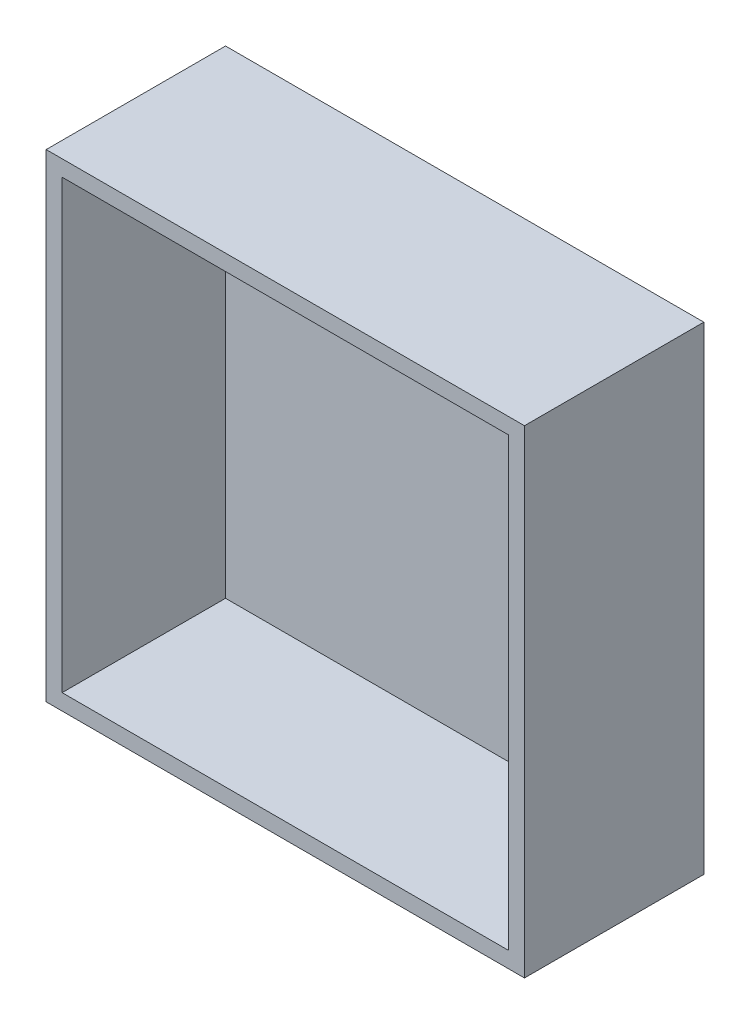
ISO-10303-21;
HEADER;
FILE_DESCRIPTION(('STEP AP214'),'2;1');
FILE_NAME('part.step','',(''),(''),'','','');
FILE_SCHEMA(('AUTOMOTIVE_DESIGN { 1 0 10303 214 1 1 1 1 }'));
ENDSEC;
DATA;
#1=APPLICATION_CONTEXT('core data for automotive mechanical design processes');
#2=APPLICATION_PROTOCOL_DEFINITION('international standard','automotive_design',2000,#1);
#3=PRODUCT_CONTEXT('',#1,'mechanical');
#4=PRODUCT('Part','Part','',(#3));
#5=PRODUCT_RELATED_PRODUCT_CATEGORY('part','',(#4));
#6=PRODUCT_DEFINITION_FORMATION('','',#4);
#7=PRODUCT_DEFINITION_CONTEXT('part definition',#1,'design');
#8=PRODUCT_DEFINITION('design','',#6,#7);
#9=PRODUCT_DEFINITION_SHAPE('','',#8);
#10=(LENGTH_UNIT() NAMED_UNIT(*) SI_UNIT(.MILLI.,.METRE.));
#11=(NAMED_UNIT(*) PLANE_ANGLE_UNIT() SI_UNIT($,.RADIAN.));
#12=(NAMED_UNIT(*) SI_UNIT($,.STERADIAN.) SOLID_ANGLE_UNIT());
#13=UNCERTAINTY_MEASURE_WITH_UNIT(LENGTH_MEASURE(1.E-05),#10,'distance_accuracy_value','');
#14=(GEOMETRIC_REPRESENTATION_CONTEXT(3) GLOBAL_UNCERTAINTY_ASSIGNED_CONTEXT((#13)) GLOBAL_UNIT_ASSIGNED_CONTEXT((#10,
#11,#12)) REPRESENTATION_CONTEXT('',''));
#15=CARTESIAN_POINT('',(0.,0.,0.));
#16=DIRECTION('',(0.,0.,1.));
#17=DIRECTION('',(1.,0.,0.));
#18=AXIS2_PLACEMENT_3D('',#15,#16,#17);
#19=CARTESIAN_POINT('',(-28.,-28.,2.));
#20=DIRECTION('',(-1.,0.,0.));
#21=DIRECTION('',(0.,-1.,0.));
#22=AXIS2_PLACEMENT_3D('',#19,#20,#21);
#23=PLANE('',#22);
#24=DIRECTION('',(0.,0.,-1.));
#25=VECTOR('',#24,1.);
#26=CARTESIAN_POINT('',(-28.,19.,11.));
#27=LINE('',#26,#25);
#28=CARTESIAN_POINT('',(-28.,19.,11.));
#29=VERTEX_POINT('',#28);
#30=CARTESIAN_POINT('',(-28.,19.,2.));
#31=VERTEX_POINT('',#30);
#32=EDGE_CURVE('E55',#29,#31,#27,.T.);
#33=ORIENTED_EDGE('',*,*,#32,.F.);
#34=DIRECTION('',(0.,-1.,0.));
#35=VECTOR('',#34,1.);
#36=CARTESIAN_POINT('',(-28.,28.,11.));
#37=LINE('',#36,#35);
#38=CARTESIAN_POINT('',(-28.,28.,11.));
#39=VERTEX_POINT('',#38);
#40=EDGE_CURVE('E130',#39,#29,#37,.T.);
#41=ORIENTED_EDGE('',*,*,#40,.F.);
#42=DIRECTION('',(0.,0.,1.));
#43=VECTOR('',#42,1.);
#44=CARTESIAN_POINT('',(-28.,28.,2.));
#45=LINE('',#44,#43);
#46=CARTESIAN_POINT('',(-28.,28.,22.5));
#47=VERTEX_POINT('',#46);
#48=EDGE_CURVE('E203',#39,#47,#45,.T.);
#49=ORIENTED_EDGE('',*,*,#48,.T.);
#50=DIRECTION('',(0.,-1.,0.));
#51=VECTOR('',#50,1.);
#52=CARTESIAN_POINT('',(-28.,-28.,22.5));
#53=LINE('',#52,#51);
#54=CARTESIAN_POINT('',(-28.,-28.,22.5));
#55=VERTEX_POINT('',#54);
#56=EDGE_CURVE('E189',#47,#55,#53,.T.);
#57=ORIENTED_EDGE('',*,*,#56,.T.);
#58=DIRECTION('',(0.,0.,1.));
#59=VECTOR('',#58,1.);
#60=CARTESIAN_POINT('',(-28.,-28.,2.));
#61=LINE('',#60,#59);
#62=CARTESIAN_POINT('',(-28.,-28.,2.));
#63=VERTEX_POINT('',#62);
#64=EDGE_CURVE('E200',#63,#55,#61,.T.);
#65=ORIENTED_EDGE('',*,*,#64,.F.);
#66=DIRECTION('',(0.,-1.,0.));
#67=VECTOR('',#66,1.);
#68=CARTESIAN_POINT('',(-28.,-28.,2.));
#69=LINE('',#68,#67);
#70=EDGE_CURVE('E175',#31,#63,#69,.T.);
#71=ORIENTED_EDGE('',*,*,#70,.F.);
#72=EDGE_LOOP('',(#33,#41,#49,#57,#65,#71));
#73=FACE_BOUND('',#72,.T.);
#74=ADVANCED_FACE('F39',(#73),#23,.F.);
#75=CARTESIAN_POINT('',(-28.,28.,2.));
#76=DIRECTION('',(0.,1.,0.));
#77=DIRECTION('',(-1.,0.,0.));
#78=AXIS2_PLACEMENT_3D('',#75,#76,#77);
#79=PLANE('',#78);
#80=DIRECTION('',(0.,0.,-1.));
#81=VECTOR('',#80,1.);
#82=CARTESIAN_POINT('',(-18.,28.,11.));
#83=LINE('',#82,#81);
#84=CARTESIAN_POINT('',(-18.,28.,11.));
#85=VERTEX_POINT('',#84);
#86=CARTESIAN_POINT('',(-18.,28.,2.));
#87=VERTEX_POINT('',#86);
#88=EDGE_CURVE('E144',#85,#87,#83,.T.);
#89=ORIENTED_EDGE('',*,*,#88,.T.);
#90=DIRECTION('',(-1.,0.,0.));
#91=VECTOR('',#90,1.);
#92=CARTESIAN_POINT('',(-28.,28.,2.));
#93=LINE('',#92,#91);
#94=CARTESIAN_POINT('',(28.,28.,2.));
#95=VERTEX_POINT('',#94);
#96=EDGE_CURVE('E170',#95,#87,#93,.T.);
#97=ORIENTED_EDGE('',*,*,#96,.F.);
#98=DIRECTION('',(0.,0.,1.));
#99=VECTOR('',#98,1.);
#100=CARTESIAN_POINT('',(28.,28.,2.));
#101=LINE('',#100,#99);
#102=CARTESIAN_POINT('',(28.,28.,22.5));
#103=VERTEX_POINT('',#102);
#104=EDGE_CURVE('E182',#95,#103,#101,.T.);
#105=ORIENTED_EDGE('',*,*,#104,.T.);
#106=DIRECTION('',(-1.,0.,0.));
#107=VECTOR('',#106,1.);
#108=CARTESIAN_POINT('',(-28.,28.,22.5));
#109=LINE('',#108,#107);
#110=EDGE_CURVE('E185',#103,#47,#109,.T.);
#111=ORIENTED_EDGE('',*,*,#110,.T.);
#112=ORIENTED_EDGE('',*,*,#48,.F.);
#113=DIRECTION('',(-1.,0.,0.));
#114=VECTOR('',#113,1.);
#115=CARTESIAN_POINT('',(-28.,28.,11.));
#116=LINE('',#115,#114);
#117=EDGE_CURVE('E63',#85,#39,#116,.T.);
#118=ORIENTED_EDGE('',*,*,#117,.F.);
#119=EDGE_LOOP('',(#89,#97,#105,#111,#112,#118));
#120=FACE_BOUND('',#119,.T.);
#121=ADVANCED_FACE('F272',(#120),#79,.F.);
#122=CARTESIAN_POINT('',(0.,0.,2.));
#123=DIRECTION('',(0.,0.,-1.));
#124=DIRECTION('',(-1.,0.,0.));
#125=AXIS2_PLACEMENT_3D('',#122,#123,#124);
#126=PLANE('',#125);
#127=DIRECTION('',(0.,1.,0.));
#128=VECTOR('',#127,1.);
#129=CARTESIAN_POINT('',(-18.,28.,2.));
#130=LINE('',#129,#128);
#131=CARTESIAN_POINT('',(-18.,19.,2.));
#132=VERTEX_POINT('',#131);
#133=EDGE_CURVE('E150',#132,#87,#130,.T.);
#134=ORIENTED_EDGE('',*,*,#133,.F.);
#135=DIRECTION('',(1.,0.,0.));
#136=VECTOR('',#135,1.);
#137=CARTESIAN_POINT('',(-28.,19.,2.));
#138=LINE('',#137,#136);
#139=EDGE_CURVE('E138',#31,#132,#138,.T.);
#140=ORIENTED_EDGE('',*,*,#139,.F.);
#141=ORIENTED_EDGE('',*,*,#70,.T.);
#142=DIRECTION('',(1.,0.,0.));
#143=VECTOR('',#142,1.);
#144=CARTESIAN_POINT('',(-28.,-28.,2.));
#145=LINE('',#144,#143);
#146=CARTESIAN_POINT('',(28.,-28.,2.));
#147=VERTEX_POINT('',#146);
#148=EDGE_CURVE('E178',#63,#147,#145,.T.);
#149=ORIENTED_EDGE('',*,*,#148,.T.);
#150=DIRECTION('',(0.,1.,0.));
#151=VECTOR('',#150,1.);
#152=CARTESIAN_POINT('',(28.,-28.,2.));
#153=LINE('',#152,#151);
#154=EDGE_CURVE('E166',#147,#95,#153,.T.);
#155=ORIENTED_EDGE('',*,*,#154,.T.);
#156=ORIENTED_EDGE('',*,*,#96,.T.);
#157=EDGE_LOOP('',(#134,#140,#141,#149,#155,#156));
#158=FACE_BOUND('',#157,.T.);
#159=ADVANCED_FACE('F270',(#158),#126,.F.);
#160=CARTESIAN_POINT('',(30.,-30.,22.5));
#161=DIRECTION('',(-1.,0.,0.));
#162=DIRECTION('',(0.,0.,1.));
#163=AXIS2_PLACEMENT_3D('',#160,#161,#162);
#164=PLANE('',#163);
#165=DIRECTION('',(0.,1.,0.));
#166=VECTOR('',#165,1.);
#167=CARTESIAN_POINT('',(30.,-30.,0.));
#168=LINE('',#167,#166);
#169=CARTESIAN_POINT('',(30.,-30.,0.));
#170=VERTEX_POINT('',#169);
#171=CARTESIAN_POINT('',(30.,30.,0.));
#172=VERTEX_POINT('',#171);
#173=EDGE_CURVE('E199',#170,#172,#168,.T.);
#174=ORIENTED_EDGE('',*,*,#173,.T.);
#175=DIRECTION('',(0.,0.,-1.));
#176=VECTOR('',#175,1.);
#177=CARTESIAN_POINT('',(30.,30.,22.5));
#178=LINE('',#177,#176);
#179=CARTESIAN_POINT('',(30.,30.,22.5));
#180=VERTEX_POINT('',#179);
#181=EDGE_CURVE('E11',#180,#172,#178,.T.);
#182=ORIENTED_EDGE('',*,*,#181,.F.);
#183=DIRECTION('',(0.,1.,0.));
#184=VECTOR('',#183,1.);
#185=CARTESIAN_POINT('',(30.,-30.,22.5));
#186=LINE('',#185,#184);
#187=CARTESIAN_POINT('',(30.,-30.,22.5));
#188=VERTEX_POINT('',#187);
#189=EDGE_CURVE('E209',#188,#180,#186,.T.);
#190=ORIENTED_EDGE('',*,*,#189,.F.);
#191=DIRECTION('',(0.,0.,-1.));
#192=VECTOR('',#191,1.);
#193=CARTESIAN_POINT('',(30.,-30.,22.5));
#194=LINE('',#193,#192);
#195=EDGE_CURVE('E223',#188,#170,#194,.T.);
#196=ORIENTED_EDGE('',*,*,#195,.T.);
#197=EDGE_LOOP('',(#174,#182,#190,#196));
#198=FACE_BOUND('',#197,.T.);
#199=ADVANCED_FACE('F41',(#198),#164,.F.);
#200=CARTESIAN_POINT('',(-30.,30.,22.5));
#201=DIRECTION('',(0.,-1.,0.));
#202=DIRECTION('',(1.,0.,0.));
#203=AXIS2_PLACEMENT_3D('',#200,#201,#202);
#204=PLANE('',#203);
#205=DIRECTION('',(-1.,0.,0.));
#206=VECTOR('',#205,1.);
#207=CARTESIAN_POINT('',(-30.,30.,0.));
#208=LINE('',#207,#206);
#209=CARTESIAN_POINT('',(-30.,30.,0.));
#210=VERTEX_POINT('',#209);
#211=EDGE_CURVE('E227',#172,#210,#208,.T.);
#212=ORIENTED_EDGE('',*,*,#211,.T.);
#213=DIRECTION('',(0.,0.,-1.));
#214=VECTOR('',#213,1.);
#215=CARTESIAN_POINT('',(-30.,30.,22.5));
#216=LINE('',#215,#214);
#217=CARTESIAN_POINT('',(-30.,30.,22.5));
#218=VERTEX_POINT('',#217);
#219=EDGE_CURVE('E48',#218,#210,#216,.T.);
#220=ORIENTED_EDGE('',*,*,#219,.F.);
#221=DIRECTION('',(-1.,0.,0.));
#222=VECTOR('',#221,1.);
#223=CARTESIAN_POINT('',(-30.,30.,22.5));
#224=LINE('',#223,#222);
#225=EDGE_CURVE('E213',#180,#218,#224,.T.);
#226=ORIENTED_EDGE('',*,*,#225,.F.);
#227=ORIENTED_EDGE('',*,*,#181,.T.);
#228=EDGE_LOOP('',(#212,#220,#226,#227));
#229=FACE_BOUND('',#228,.T.);
#230=ADVANCED_FACE('F263',(#229),#204,.F.);
#231=CARTESIAN_POINT('',(-30.,-30.,22.5));
#232=DIRECTION('',(1.,0.,0.));
#233=DIRECTION('',(0.,1.,0.));
#234=AXIS2_PLACEMENT_3D('',#231,#232,#233);
#235=PLANE('',#234);
#236=DIRECTION('',(0.,-1.,0.));
#237=VECTOR('',#236,1.);
#238=CARTESIAN_POINT('',(-30.,-30.,0.));
#239=LINE('',#238,#237);
#240=CARTESIAN_POINT('',(-30.,-30.,0.));
#241=VERTEX_POINT('',#240);
#242=EDGE_CURVE('E230',#210,#241,#239,.T.);
#243=ORIENTED_EDGE('',*,*,#242,.T.);
#244=DIRECTION('',(0.,0.,-1.));
#245=VECTOR('',#244,1.);
#246=CARTESIAN_POINT('',(-30.,-30.,22.5));
#247=LINE('',#246,#245);
#248=CARTESIAN_POINT('',(-30.,-30.,22.5));
#249=VERTEX_POINT('',#248);
#250=EDGE_CURVE('E238',#249,#241,#247,.T.);
#251=ORIENTED_EDGE('',*,*,#250,.F.);
#252=DIRECTION('',(0.,-1.,0.));
#253=VECTOR('',#252,1.);
#254=CARTESIAN_POINT('',(-30.,-30.,22.5));
#255=LINE('',#254,#253);
#256=EDGE_CURVE('E217',#218,#249,#255,.T.);
#257=ORIENTED_EDGE('',*,*,#256,.F.);
#258=ORIENTED_EDGE('',*,*,#219,.T.);
#259=EDGE_LOOP('',(#243,#251,#257,#258));
#260=FACE_BOUND('',#259,.T.);
#261=ADVANCED_FACE('F247',(#260),#235,.F.);
#262=CARTESIAN_POINT('',(-30.,-30.,22.5));
#263=DIRECTION('',(0.,1.,0.));
#264=DIRECTION('',(-1.,0.,0.));
#265=AXIS2_PLACEMENT_3D('',#262,#263,#264);
#266=PLANE('',#265);
#267=DIRECTION('',(1.,0.,0.));
#268=VECTOR('',#267,1.);
#269=CARTESIAN_POINT('',(-30.,-30.,0.));
#270=LINE('',#269,#268);
#271=EDGE_CURVE('E214',#241,#170,#270,.T.);
#272=ORIENTED_EDGE('',*,*,#271,.T.);
#273=ORIENTED_EDGE('',*,*,#195,.F.);
#274=DIRECTION('',(1.,0.,0.));
#275=VECTOR('',#274,1.);
#276=CARTESIAN_POINT('',(-30.,-30.,22.5));
#277=LINE('',#276,#275);
#278=EDGE_CURVE('E220',#249,#188,#277,.T.);
#279=ORIENTED_EDGE('',*,*,#278,.F.);
#280=ORIENTED_EDGE('',*,*,#250,.T.);
#281=EDGE_LOOP('',(#272,#273,#279,#280));
#282=FACE_BOUND('',#281,.T.);
#283=ADVANCED_FACE('F256',(#282),#266,.F.);
#284=CARTESIAN_POINT('',(0.,0.,22.5));
#285=DIRECTION('',(0.,0.,-1.));
#286=DIRECTION('',(-1.,0.,0.));
#287=AXIS2_PLACEMENT_3D('',#284,#285,#286);
#288=PLANE('',#287);
#289=ORIENTED_EDGE('',*,*,#110,.F.);
#290=DIRECTION('',(0.,1.,0.));
#291=VECTOR('',#290,1.);
#292=CARTESIAN_POINT('',(28.,-28.,22.5));
#293=LINE('',#292,#291);
#294=CARTESIAN_POINT('',(28.,-28.,22.5));
#295=VERTEX_POINT('',#294);
#296=EDGE_CURVE('E165',#295,#103,#293,.T.);
#297=ORIENTED_EDGE('',*,*,#296,.F.);
#298=DIRECTION('',(1.,0.,0.));
#299=VECTOR('',#298,1.);
#300=CARTESIAN_POINT('',(-28.,-28.,22.5));
#301=LINE('',#300,#299);
#302=EDGE_CURVE('E171',#55,#295,#301,.T.);
#303=ORIENTED_EDGE('',*,*,#302,.F.);
#304=ORIENTED_EDGE('',*,*,#56,.F.);
#305=EDGE_LOOP('',(#289,#297,#303,#304));
#306=FACE_BOUND('',#305,.T.);
#307=ORIENTED_EDGE('',*,*,#189,.T.);
#308=ORIENTED_EDGE('',*,*,#225,.T.);
#309=ORIENTED_EDGE('',*,*,#256,.T.);
#310=ORIENTED_EDGE('',*,*,#278,.T.);
#311=EDGE_LOOP('',(#307,#308,#309,#310));
#312=FACE_BOUND('',#311,.T.);
#313=ADVANCED_FACE('F262',(#306,#312),#288,.F.);
#314=CARTESIAN_POINT('',(0.,0.,0.));
#315=DIRECTION('',(0.,0.,-1.));
#316=DIRECTION('',(-1.,0.,0.));
#317=AXIS2_PLACEMENT_3D('',#314,#315,#316);
#318=PLANE('',#317);
#319=ORIENTED_EDGE('',*,*,#173,.F.);
#320=ORIENTED_EDGE('',*,*,#271,.F.);
#321=ORIENTED_EDGE('',*,*,#242,.F.);
#322=ORIENTED_EDGE('',*,*,#211,.F.);
#323=EDGE_LOOP('',(#319,#320,#321,#322));
#324=FACE_BOUND('',#323,.T.);
#325=ADVANCED_FACE('F253',(#324),#318,.T.);
#326=CARTESIAN_POINT('',(28.,-28.,2.));
#327=DIRECTION('',(1.,0.,0.));
#328=DIRECTION('',(0.,0.,-1.));
#329=AXIS2_PLACEMENT_3D('',#326,#327,#328);
#330=PLANE('',#329);
#331=ORIENTED_EDGE('',*,*,#296,.T.);
#332=ORIENTED_EDGE('',*,*,#104,.F.);
#333=ORIENTED_EDGE('',*,*,#154,.F.);
#334=DIRECTION('',(0.,0.,1.));
#335=VECTOR('',#334,1.);
#336=CARTESIAN_POINT('',(28.,-28.,2.));
#337=LINE('',#336,#335);
#338=EDGE_CURVE('E196',#147,#295,#337,.T.);
#339=ORIENTED_EDGE('',*,*,#338,.T.);
#340=EDGE_LOOP('',(#331,#332,#333,#339));
#341=FACE_BOUND('',#340,.T.);
#342=ADVANCED_FACE('F283',(#341),#330,.F.);
#343=CARTESIAN_POINT('',(-28.,-28.,2.));
#344=DIRECTION('',(0.,-1.,0.));
#345=DIRECTION('',(1.,0.,0.));
#346=AXIS2_PLACEMENT_3D('',#343,#344,#345);
#347=PLANE('',#346);
#348=ORIENTED_EDGE('',*,*,#302,.T.);
#349=ORIENTED_EDGE('',*,*,#338,.F.);
#350=ORIENTED_EDGE('',*,*,#148,.F.);
#351=ORIENTED_EDGE('',*,*,#64,.T.);
#352=EDGE_LOOP('',(#348,#349,#350,#351));
#353=FACE_BOUND('',#352,.T.);
#354=ADVANCED_FACE('F280',(#353),#347,.F.);
#355=CARTESIAN_POINT('',(-18.,28.,11.));
#356=DIRECTION('',(-1.,0.,0.));
#357=DIRECTION('',(0.,0.,1.));
#358=AXIS2_PLACEMENT_3D('',#355,#356,#357);
#359=PLANE('',#358);
#360=ORIENTED_EDGE('',*,*,#133,.T.);
#361=ORIENTED_EDGE('',*,*,#88,.F.);
#362=DIRECTION('',(0.,1.,0.));
#363=VECTOR('',#362,1.);
#364=CARTESIAN_POINT('',(-18.,28.,11.));
#365=LINE('',#364,#363);
#366=CARTESIAN_POINT('',(-18.,19.,11.));
#367=VERTEX_POINT('',#366);
#368=EDGE_CURVE('E128',#367,#85,#365,.T.);
#369=ORIENTED_EDGE('',*,*,#368,.F.);
#370=DIRECTION('',(0.,0.,-1.));
#371=VECTOR('',#370,1.);
#372=CARTESIAN_POINT('',(-18.,19.,11.));
#373=LINE('',#372,#371);
#374=EDGE_CURVE('E133',#367,#132,#373,.T.);
#375=ORIENTED_EDGE('',*,*,#374,.T.);
#376=EDGE_LOOP('',(#360,#361,#369,#375));
#377=FACE_BOUND('',#376,.T.);
#378=ADVANCED_FACE('F143',(#377),#359,.F.);
#379=CARTESIAN_POINT('',(-28.,19.,11.));
#380=DIRECTION('',(0.,1.,0.));
#381=DIRECTION('',(0.,0.,1.));
#382=AXIS2_PLACEMENT_3D('',#379,#380,#381);
#383=PLANE('',#382);
#384=ORIENTED_EDGE('',*,*,#139,.T.);
#385=ORIENTED_EDGE('',*,*,#374,.F.);
#386=DIRECTION('',(1.,0.,0.));
#387=VECTOR('',#386,1.);
#388=CARTESIAN_POINT('',(-28.,19.,11.));
#389=LINE('',#388,#387);
#390=EDGE_CURVE('E124',#29,#367,#389,.T.);
#391=ORIENTED_EDGE('',*,*,#390,.F.);
#392=ORIENTED_EDGE('',*,*,#32,.T.);
#393=EDGE_LOOP('',(#384,#385,#391,#392));
#394=FACE_BOUND('',#393,.T.);
#395=ADVANCED_FACE('F137',(#394),#383,.F.);
#396=CARTESIAN_POINT('',(0.,0.,11.));
#397=DIRECTION('',(0.,0.,1.));
#398=DIRECTION('',(1.,0.,0.));
#399=AXIS2_PLACEMENT_3D('',#396,#397,#398);
#400=PLANE('',#399);
#401=CARTESIAN_POINT('',(-23.,23.5,11.));
#402=DIRECTION('',(0.,0.,1.));
#403=DIRECTION('',(1.,0.,0.));
#404=AXIS2_PLACEMENT_3D('',#401,#402,#403);
#405=CIRCLE('',#404,1.);
#406=CARTESIAN_POINT('',(-22.,23.5,11.));
#407=VERTEX_POINT('',#406);
#408=EDGE_CURVE('E153',#407,#407,#405,.T.);
#409=ORIENTED_EDGE('',*,*,#408,.F.);
#410=EDGE_LOOP('',(#409));
#411=FACE_BOUND('',#410,.T.);
#412=ORIENTED_EDGE('',*,*,#368,.T.);
#413=ORIENTED_EDGE('',*,*,#117,.T.);
#414=ORIENTED_EDGE('',*,*,#40,.T.);
#415=ORIENTED_EDGE('',*,*,#390,.T.);
#416=EDGE_LOOP('',(#412,#413,#414,#415));
#417=FACE_BOUND('',#416,.T.);
#418=ADVANCED_FACE('F126',(#411,#417),#400,.T.);
#419=CARTESIAN_POINT('',(-23.,23.5,2.2));
#420=DIRECTION('',(0.,0.,1.));
#421=DIRECTION('',(1.,0.,0.));
#422=AXIS2_PLACEMENT_3D('',#419,#420,#421);
#423=CYLINDRICAL_SURFACE('',#422,1.);
#424=CARTESIAN_POINT('',(-23.,23.5,2.2));
#425=DIRECTION('',(0.,0.,1.));
#426=DIRECTION('',(1.,0.,0.));
#427=AXIS2_PLACEMENT_3D('',#424,#425,#426);
#428=CIRCLE('',#427,1.);
#429=CARTESIAN_POINT('',(-22.,23.5,2.2));
#430=VERTEX_POINT('',#429);
#431=EDGE_CURVE('E159',#430,#430,#428,.T.);
#432=ORIENTED_EDGE('',*,*,#431,.F.);
#433=EDGE_LOOP('',(#432));
#434=FACE_BOUND('',#433,.T.);
#435=ORIENTED_EDGE('',*,*,#408,.T.);
#436=EDGE_LOOP('',(#435));
#437=FACE_BOUND('',#436,.T.);
#438=ADVANCED_FACE('F348',(#434,#437),#423,.F.);
#439=CARTESIAN_POINT('',(-23.,23.5,2.2));
#440=DIRECTION('',(0.,0.,1.));
#441=DIRECTION('',(1.,0.,0.));
#442=AXIS2_PLACEMENT_3D('',#439,#440,#441);
#443=PLANE('',#442);
#444=ORIENTED_EDGE('',*,*,#431,.T.);
#445=EDGE_LOOP('',(#444));
#446=FACE_BOUND('',#445,.T.);
#447=ADVANCED_FACE('F356',(#446),#443,.T.);
#448=CLOSED_SHELL('',(#74,#121,#159,#199,#230,#261,#283,#313,#325,#342,#354,#378,#395,#418,#438,#447));
#449=MANIFOLD_SOLID_BREP('B2',#448);
#450=ADVANCED_BREP_SHAPE_REPRESENTATION('',(#18,#449),#14);
#451=SHAPE_DEFINITION_REPRESENTATION(#9,#450);
ENDSEC;
END-ISO-10303-21;
